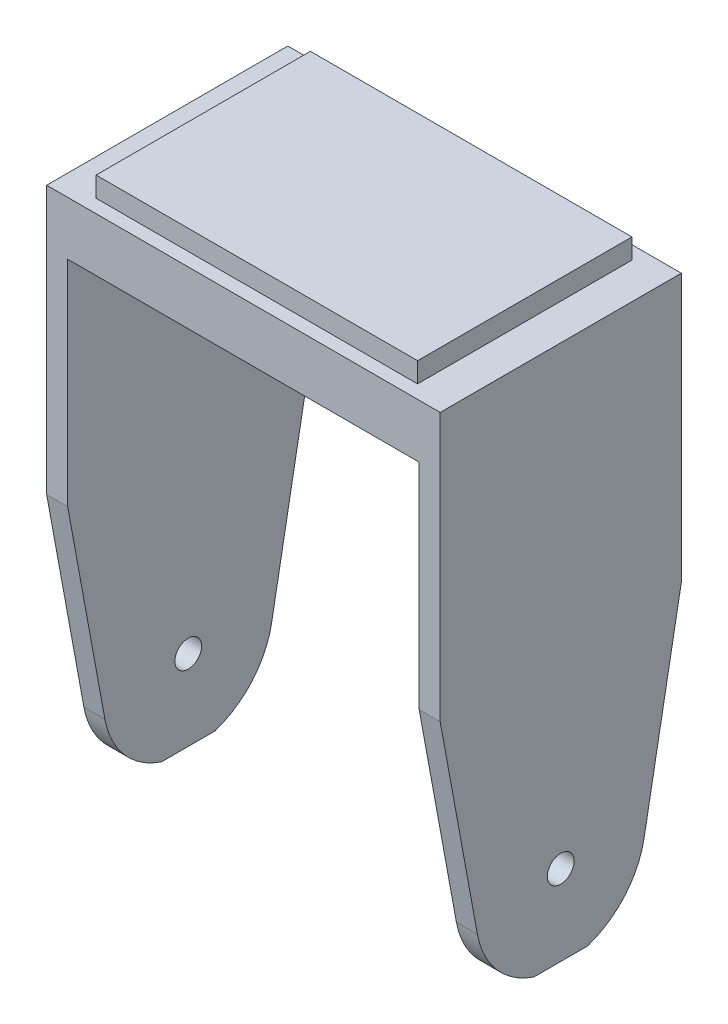
ISO-10303-21;
HEADER;
FILE_DESCRIPTION(('STEP AP214'),'2;1');
FILE_NAME('part.step','',(''),(''),'','','');
FILE_SCHEMA(('AUTOMOTIVE_DESIGN { 1 0 10303 214 1 1 1 1 }'));
ENDSEC;
DATA;
#1=APPLICATION_CONTEXT('core data for automotive mechanical design processes');
#2=APPLICATION_PROTOCOL_DEFINITION('international standard','automotive_design',2000,#1);
#3=PRODUCT_CONTEXT('',#1,'mechanical');
#4=PRODUCT('Part','Part','',(#3));
#5=PRODUCT_RELATED_PRODUCT_CATEGORY('part','',(#4));
#6=PRODUCT_DEFINITION_FORMATION('','',#4);
#7=PRODUCT_DEFINITION_CONTEXT('part definition',#1,'design');
#8=PRODUCT_DEFINITION('design','',#6,#7);
#9=PRODUCT_DEFINITION_SHAPE('','',#8);
#10=(LENGTH_UNIT() NAMED_UNIT(*) SI_UNIT(.MILLI.,.METRE.));
#11=(NAMED_UNIT(*) PLANE_ANGLE_UNIT() SI_UNIT($,.RADIAN.));
#12=(NAMED_UNIT(*) SI_UNIT($,.STERADIAN.) SOLID_ANGLE_UNIT());
#13=UNCERTAINTY_MEASURE_WITH_UNIT(LENGTH_MEASURE(1.E-05),#10,'distance_accuracy_value','');
#14=(GEOMETRIC_REPRESENTATION_CONTEXT(3) GLOBAL_UNCERTAINTY_ASSIGNED_CONTEXT((#13)) GLOBAL_UNIT_ASSIGNED_CONTEXT((#10,
#11,#12)) REPRESENTATION_CONTEXT('',''));
#15=CARTESIAN_POINT('',(0.,0.,0.));
#16=DIRECTION('',(0.,0.,1.));
#17=DIRECTION('',(1.,0.,0.));
#18=AXIS2_PLACEMENT_3D('',#15,#16,#17);
#19=CARTESIAN_POINT('',(23.3172,-8.73125,-14.2875));
#20=DIRECTION('',(0.,1.,0.));
#21=DIRECTION('',(0.,0.,1.));
#22=AXIS2_PLACEMENT_3D('',#19,#20,#21);
#23=PLANE('',#22);
#24=DIRECTION('',(0.,0.,1.));
#25=VECTOR('',#24,1.);
#26=CARTESIAN_POINT('',(20.828,-8.73125,-14.2875));
#27=LINE('',#26,#25);
#28=CARTESIAN_POINT('',(20.828,-8.73125,-14.2875));
#29=VERTEX_POINT('',#28);
#30=CARTESIAN_POINT('',(20.828,-8.73125,14.2875));
#31=VERTEX_POINT('',#30);
#32=EDGE_CURVE('E378',#29,#31,#27,.T.);
#33=ORIENTED_EDGE('',*,*,#32,.T.);
#34=DIRECTION('',(-1.,0.,0.));
#35=VECTOR('',#34,1.);
#36=CARTESIAN_POINT('',(23.3172,-8.73125,14.2875));
#37=LINE('',#36,#35);
#38=CARTESIAN_POINT('',(-20.828,-8.73125,14.2875));
#39=VERTEX_POINT('',#38);
#40=EDGE_CURVE('E364',#31,#39,#37,.T.);
#41=ORIENTED_EDGE('',*,*,#40,.T.);
#42=DIRECTION('',(0.,0.,1.));
#43=VECTOR('',#42,1.);
#44=CARTESIAN_POINT('',(-20.828,-8.73125,14.2875));
#45=LINE('',#44,#43);
#46=CARTESIAN_POINT('',(-20.828,-8.73125,-14.2875));
#47=VERTEX_POINT('',#46);
#48=EDGE_CURVE('E605',#47,#39,#45,.T.);
#49=ORIENTED_EDGE('',*,*,#48,.F.);
#50=DIRECTION('',(1.,0.,0.));
#51=VECTOR('',#50,1.);
#52=CARTESIAN_POINT('',(23.3172,-8.73125,-14.2875));
#53=LINE('',#52,#51);
#54=EDGE_CURVE('E383',#47,#29,#53,.T.);
#55=ORIENTED_EDGE('',*,*,#54,.T.);
#56=EDGE_LOOP('',(#33,#41,#49,#55));
#57=FACE_BOUND('',#56,.T.);
#58=ADVANCED_FACE('F360',(#57),#23,.F.);
#59=CARTESIAN_POINT('',(-19.05,-2.38125,-12.7));
#60=DIRECTION('',(-1.,0.,0.));
#61=DIRECTION('',(0.,0.,1.));
#62=AXIS2_PLACEMENT_3D('',#59,#60,#61);
#63=PLANE('',#62);
#64=DIRECTION('',(0.,0.,1.));
#65=VECTOR('',#64,1.);
#66=CARTESIAN_POINT('',(-19.05,0.,-12.7));
#67=LINE('',#66,#65);
#68=CARTESIAN_POINT('',(-19.05,0.,-12.7));
#69=VERTEX_POINT('',#68);
#70=CARTESIAN_POINT('',(-19.05,0.,12.7));
#71=VERTEX_POINT('',#70);
#72=EDGE_CURVE('E509',#69,#71,#67,.T.);
#73=ORIENTED_EDGE('',*,*,#72,.F.);
#74=DIRECTION('',(0.,1.,0.));
#75=VECTOR('',#74,1.);
#76=CARTESIAN_POINT('',(-19.05,-2.38125,-12.7));
#77=LINE('',#76,#75);
#78=CARTESIAN_POINT('',(-19.05,-2.38125,-12.7));
#79=VERTEX_POINT('',#78);
#80=EDGE_CURVE('E11',#79,#69,#77,.T.);
#81=ORIENTED_EDGE('',*,*,#80,.F.);
#82=DIRECTION('',(0.,0.,1.));
#83=VECTOR('',#82,1.);
#84=CARTESIAN_POINT('',(-19.05,-2.38125,-12.7));
#85=LINE('',#84,#83);
#86=CARTESIAN_POINT('',(-19.05,-2.38125,12.7));
#87=VERTEX_POINT('',#86);
#88=EDGE_CURVE('E656',#79,#87,#85,.T.);
#89=ORIENTED_EDGE('',*,*,#88,.T.);
#90=DIRECTION('',(0.,1.,0.));
#91=VECTOR('',#90,1.);
#92=CARTESIAN_POINT('',(-19.05,-2.38125,12.7));
#93=LINE('',#92,#91);
#94=EDGE_CURVE('E667',#87,#71,#93,.T.);
#95=ORIENTED_EDGE('',*,*,#94,.T.);
#96=EDGE_LOOP('',(#73,#81,#89,#95));
#97=FACE_BOUND('',#96,.T.);
#98=ADVANCED_FACE('F362',(#97),#63,.T.);
#99=CARTESIAN_POINT('',(-19.05,-2.38125,-12.7));
#100=DIRECTION('',(0.,0.,-1.));
#101=DIRECTION('',(-1.,0.,0.));
#102=AXIS2_PLACEMENT_3D('',#99,#100,#101);
#103=PLANE('',#102);
#104=DIRECTION('',(-1.,0.,0.));
#105=VECTOR('',#104,1.);
#106=CARTESIAN_POINT('',(-19.05,0.,-12.7));
#107=LINE('',#106,#105);
#108=CARTESIAN_POINT('',(19.05,0.,-12.7));
#109=VERTEX_POINT('',#108);
#110=EDGE_CURVE('E653',#109,#69,#107,.T.);
#111=ORIENTED_EDGE('',*,*,#110,.F.);
#112=DIRECTION('',(0.,1.,0.));
#113=VECTOR('',#112,1.);
#114=CARTESIAN_POINT('',(19.05,-2.38125,-12.7));
#115=LINE('',#114,#113);
#116=CARTESIAN_POINT('',(19.05,-2.38125,-12.7));
#117=VERTEX_POINT('',#116);
#118=EDGE_CURVE('E370',#117,#109,#115,.T.);
#119=ORIENTED_EDGE('',*,*,#118,.F.);
#120=DIRECTION('',(-1.,0.,0.));
#121=VECTOR('',#120,1.);
#122=CARTESIAN_POINT('',(-19.05,-2.38125,-12.7));
#123=LINE('',#122,#121);
#124=EDGE_CURVE('E665',#117,#79,#123,.T.);
#125=ORIENTED_EDGE('',*,*,#124,.T.);
#126=ORIENTED_EDGE('',*,*,#80,.T.);
#127=EDGE_LOOP('',(#111,#119,#125,#126));
#128=FACE_BOUND('',#127,.T.);
#129=ADVANCED_FACE('F685',(#128),#103,.T.);
#130=CARTESIAN_POINT('',(19.05,-2.38125,-12.7));
#131=DIRECTION('',(1.,0.,0.));
#132=DIRECTION('',(0.,0.,-1.));
#133=AXIS2_PLACEMENT_3D('',#130,#131,#132);
#134=PLANE('',#133);
#135=DIRECTION('',(0.,0.,-1.));
#136=VECTOR('',#135,1.);
#137=CARTESIAN_POINT('',(19.05,0.,-12.7));
#138=LINE('',#137,#136);
#139=CARTESIAN_POINT('',(19.05,0.,12.7));
#140=VERTEX_POINT('',#139);
#141=EDGE_CURVE('E650',#140,#109,#138,.T.);
#142=ORIENTED_EDGE('',*,*,#141,.F.);
#143=DIRECTION('',(0.,1.,0.));
#144=VECTOR('',#143,1.);
#145=CARTESIAN_POINT('',(19.05,-2.38125,12.7));
#146=LINE('',#145,#144);
#147=CARTESIAN_POINT('',(19.05,-2.38125,12.7));
#148=VERTEX_POINT('',#147);
#149=EDGE_CURVE('E670',#148,#140,#146,.T.);
#150=ORIENTED_EDGE('',*,*,#149,.F.);
#151=DIRECTION('',(0.,0.,-1.));
#152=VECTOR('',#151,1.);
#153=CARTESIAN_POINT('',(19.05,-2.38125,-12.7));
#154=LINE('',#153,#152);
#155=EDGE_CURVE('E662',#148,#117,#154,.T.);
#156=ORIENTED_EDGE('',*,*,#155,.T.);
#157=ORIENTED_EDGE('',*,*,#118,.T.);
#158=EDGE_LOOP('',(#142,#150,#156,#157));
#159=FACE_BOUND('',#158,.T.);
#160=ADVANCED_FACE('F690',(#159),#134,.T.);
#161=CARTESIAN_POINT('',(-19.05,-2.38125,12.7));
#162=DIRECTION('',(0.,0.,1.));
#163=DIRECTION('',(1.,0.,0.));
#164=AXIS2_PLACEMENT_3D('',#161,#162,#163);
#165=PLANE('',#164);
#166=DIRECTION('',(1.,0.,0.));
#167=VECTOR('',#166,1.);
#168=CARTESIAN_POINT('',(-19.05,0.,12.7));
#169=LINE('',#168,#167);
#170=EDGE_CURVE('E647',#71,#140,#169,.T.);
#171=ORIENTED_EDGE('',*,*,#170,.F.);
#172=ORIENTED_EDGE('',*,*,#94,.F.);
#173=DIRECTION('',(1.,0.,0.));
#174=VECTOR('',#173,1.);
#175=CARTESIAN_POINT('',(-19.05,-2.38125,12.7));
#176=LINE('',#175,#174);
#177=EDGE_CURVE('E659',#87,#148,#176,.T.);
#178=ORIENTED_EDGE('',*,*,#177,.T.);
#179=ORIENTED_EDGE('',*,*,#149,.T.);
#180=EDGE_LOOP('',(#171,#172,#178,#179));
#181=FACE_BOUND('',#180,.T.);
#182=ADVANCED_FACE('F677',(#181),#165,.T.);
#183=CARTESIAN_POINT('',(-19.05,0.,12.7));
#184=DIRECTION('',(0.,1.,0.));
#185=DIRECTION('',(0.,0.,1.));
#186=AXIS2_PLACEMENT_3D('',#183,#184,#185);
#187=PLANE('',#186);
#188=ORIENTED_EDGE('',*,*,#72,.T.);
#189=ORIENTED_EDGE('',*,*,#170,.T.);
#190=ORIENTED_EDGE('',*,*,#141,.T.);
#191=ORIENTED_EDGE('',*,*,#110,.T.);
#192=EDGE_LOOP('',(#188,#189,#190,#191));
#193=FACE_BOUND('',#192,.T.);
#194=ADVANCED_FACE('F681',(#193),#187,.T.);
#195=CARTESIAN_POINT('',(23.3172,-8.73125,14.2875));
#196=DIRECTION('',(-1.,0.,0.));
#197=DIRECTION('',(0.,0.,1.));
#198=AXIS2_PLACEMENT_3D('',#195,#196,#197);
#199=PLANE('',#198);
#200=DIRECTION('',(0.,0.,1.));
#201=VECTOR('',#200,1.);
#202=CARTESIAN_POINT('',(23.3172,-2.38125,14.2875));
#203=LINE('',#202,#201);
#204=CARTESIAN_POINT('',(23.3172,-2.38125,-14.2875));
#205=VERTEX_POINT('',#204);
#206=CARTESIAN_POINT('',(23.3172,-2.38125,14.2875));
#207=VERTEX_POINT('',#206);
#208=EDGE_CURVE('E507',#205,#207,#203,.T.);
#209=ORIENTED_EDGE('',*,*,#208,.T.);
#210=DIRECTION('',(0.,1.,0.));
#211=VECTOR('',#210,1.);
#212=CARTESIAN_POINT('',(23.3172,-8.73125,14.2875));
#213=LINE('',#212,#211);
#214=CARTESIAN_POINT('',(23.3172,-34.13125,14.2875));
#215=VERTEX_POINT('',#214);
#216=EDGE_CURVE('E498',#215,#207,#213,.T.);
#217=ORIENTED_EDGE('',*,*,#216,.F.);
#218=DIRECTION('',(0.,-0.983567719638267,-0.180539582600546));
#219=VECTOR('',#218,1.);
#220=CARTESIAN_POINT('',(23.3172,-34.13125,14.2875));
#221=LINE('',#220,#219);
#222=CARTESIAN_POINT('',(23.3172,-58.1689092170474,9.87524767096264));
#223=VERTEX_POINT('',#222);
#224=EDGE_CURVE('E504',#215,#223,#221,.T.);
#225=ORIENTED_EDGE('',*,*,#224,.T.);
#226=CARTESIAN_POINT('',(23.3172,-56.35625,0.));
#227=DIRECTION('',(1.,0.,0.));
#228=DIRECTION('',(0.,0.,-1.));
#229=AXIS2_PLACEMENT_3D('',#226,#227,#228);
#230=CIRCLE('',#229,10.0402315710346);
#231=CARTESIAN_POINT('',(23.3172,-65.88125,3.175));
#232=VERTEX_POINT('',#231);
#233=EDGE_CURVE('E525',#223,#232,#230,.T.);
#234=ORIENTED_EDGE('',*,*,#233,.T.);
#235=DIRECTION('',(0.,0.,-1.));
#236=VECTOR('',#235,1.);
#237=CARTESIAN_POINT('',(23.3172,-65.88125,3.175));
#238=LINE('',#237,#236);
#239=CARTESIAN_POINT('',(23.3172,-65.88125,-3.175));
#240=VERTEX_POINT('',#239);
#241=EDGE_CURVE('E528',#232,#240,#238,.T.);
#242=ORIENTED_EDGE('',*,*,#241,.T.);
#243=CARTESIAN_POINT('',(23.3172,-56.35625,0.));
#244=DIRECTION('',(1.,0.,0.));
#245=DIRECTION('',(0.,0.,-1.));
#246=AXIS2_PLACEMENT_3D('',#243,#244,#245);
#247=CIRCLE('',#246,10.0402315710346);
#248=CARTESIAN_POINT('',(23.3172,-58.1689092170474,-9.87524767096263));
#249=VERTEX_POINT('',#248);
#250=EDGE_CURVE('E537',#240,#249,#247,.T.);
#251=ORIENTED_EDGE('',*,*,#250,.T.);
#252=DIRECTION('',(0.,0.983567719638267,-0.180539582600546));
#253=VECTOR('',#252,1.);
#254=CARTESIAN_POINT('',(23.3172,-58.1689092170474,-9.87524767096263));
#255=LINE('',#254,#253);
#256=CARTESIAN_POINT('',(23.3172,-34.13125,-14.2875));
#257=VERTEX_POINT('',#256);
#258=EDGE_CURVE('E540',#249,#257,#255,.T.);
#259=ORIENTED_EDGE('',*,*,#258,.T.);
#260=DIRECTION('',(0.,1.,0.));
#261=VECTOR('',#260,1.);
#262=CARTESIAN_POINT('',(23.3172,-8.73125,-14.2875));
#263=LINE('',#262,#261);
#264=EDGE_CURVE('E629',#257,#205,#263,.T.);
#265=ORIENTED_EDGE('',*,*,#264,.T.);
#266=EDGE_LOOP('',(#209,#217,#225,#234,#242,#251,#259,#265));
#267=FACE_BOUND('',#266,.T.);
#268=CARTESIAN_POINT('',(23.3172,-56.35625,0.));
#269=DIRECTION('',(1.,0.,0.));
#270=DIRECTION('',(0.,0.,-1.));
#271=AXIS2_PLACEMENT_3D('',#268,#269,#270);
#272=CIRCLE('',#271,1.5875);
#273=CARTESIAN_POINT('',(23.3172,-56.35625,-1.58750000000001));
#274=VERTEX_POINT('',#273);
#275=EDGE_CURVE('E531',#274,#274,#272,.T.);
#276=ORIENTED_EDGE('',*,*,#275,.F.);
#277=EDGE_LOOP('',(#276));
#278=FACE_BOUND('',#277,.T.);
#279=ADVANCED_FACE('F500',(#267,#278),#199,.F.);
#280=CARTESIAN_POINT('',(23.3172,-8.73125,14.2875));
#281=DIRECTION('',(0.,0.,-1.));
#282=DIRECTION('',(-1.,0.,0.));
#283=AXIS2_PLACEMENT_3D('',#280,#281,#282);
#284=PLANE('',#283);
#285=DIRECTION('',(-1.,0.,0.));
#286=VECTOR('',#285,1.);
#287=CARTESIAN_POINT('',(23.3172,-2.38125,14.2875));
#288=LINE('',#287,#286);
#289=CARTESIAN_POINT('',(-23.3172,-2.38125,14.2875));
#290=VERTEX_POINT('',#289);
#291=EDGE_CURVE('E636',#207,#290,#288,.T.);
#292=ORIENTED_EDGE('',*,*,#291,.T.);
#293=DIRECTION('',(0.,1.,0.));
#294=VECTOR('',#293,1.);
#295=CARTESIAN_POINT('',(-23.3172,-8.73125,14.2875));
#296=LINE('',#295,#294);
#297=CARTESIAN_POINT('',(-23.3172,-34.13125,14.2875));
#298=VERTEX_POINT('',#297);
#299=EDGE_CURVE('E510',#298,#290,#296,.T.);
#300=ORIENTED_EDGE('',*,*,#299,.F.);
#301=DIRECTION('',(-1.,0.,0.));
#302=VECTOR('',#301,1.);
#303=CARTESIAN_POINT('',(-20.828,-34.13125,14.2875));
#304=LINE('',#303,#302);
#305=CARTESIAN_POINT('',(-20.828,-34.13125,14.2875));
#306=VERTEX_POINT('',#305);
#307=EDGE_CURVE('E890',#306,#298,#304,.T.);
#308=ORIENTED_EDGE('',*,*,#307,.F.);
#309=DIRECTION('',(0.,-1.,0.));
#310=VECTOR('',#309,1.);
#311=CARTESIAN_POINT('',(-20.828,-8.73125,14.2875));
#312=LINE('',#311,#310);
#313=EDGE_CURVE('E588',#39,#306,#312,.T.);
#314=ORIENTED_EDGE('',*,*,#313,.F.);
#315=ORIENTED_EDGE('',*,*,#40,.F.);
#316=DIRECTION('',(0.,-1.,0.));
#317=VECTOR('',#316,1.);
#318=CARTESIAN_POINT('',(20.828,-8.73125,14.2875));
#319=LINE('',#318,#317);
#320=CARTESIAN_POINT('',(20.828,-34.13125,14.2875));
#321=VERTEX_POINT('',#320);
#322=EDGE_CURVE('E516',#31,#321,#319,.T.);
#323=ORIENTED_EDGE('',*,*,#322,.T.);
#324=DIRECTION('',(1.,0.,0.));
#325=VECTOR('',#324,1.);
#326=CARTESIAN_POINT('',(20.828,-34.13125,14.2875));
#327=LINE('',#326,#325);
#328=EDGE_CURVE('E513',#321,#215,#327,.T.);
#329=ORIENTED_EDGE('',*,*,#328,.T.);
#330=ORIENTED_EDGE('',*,*,#216,.T.);
#331=EDGE_LOOP('',(#292,#300,#308,#314,#315,#323,#329,#330));
#332=FACE_BOUND('',#331,.T.);
#333=ADVANCED_FACE('F514',(#332),#284,.F.);
#334=CARTESIAN_POINT('',(-23.3172,-8.73125,14.2875));
#335=DIRECTION('',(1.,0.,0.));
#336=DIRECTION('',(0.,0.,-1.));
#337=AXIS2_PLACEMENT_3D('',#334,#335,#336);
#338=PLANE('',#337);
#339=DIRECTION('',(0.,0.,-1.));
#340=VECTOR('',#339,1.);
#341=CARTESIAN_POINT('',(-23.3172,-2.38125,14.2875));
#342=LINE('',#341,#340);
#343=CARTESIAN_POINT('',(-23.3172,-2.38125,-14.2875));
#344=VERTEX_POINT('',#343);
#345=EDGE_CURVE('E633',#290,#344,#342,.T.);
#346=ORIENTED_EDGE('',*,*,#345,.T.);
#347=DIRECTION('',(0.,1.,0.));
#348=VECTOR('',#347,1.);
#349=CARTESIAN_POINT('',(-23.3172,-8.73125,-14.2875));
#350=LINE('',#349,#348);
#351=CARTESIAN_POINT('',(-23.3172,-34.13125,-14.2875));
#352=VERTEX_POINT('',#351);
#353=EDGE_CURVE('E630',#352,#344,#350,.T.);
#354=ORIENTED_EDGE('',*,*,#353,.F.);
#355=DIRECTION('',(0.,0.983567719638267,-0.180539582600546));
#356=VECTOR('',#355,1.);
#357=CARTESIAN_POINT('',(-23.3172,-34.13125,-14.2875));
#358=LINE('',#357,#356);
#359=CARTESIAN_POINT('',(-23.3172,-58.1689092170474,-9.87524767096264));
#360=VERTEX_POINT('',#359);
#361=EDGE_CURVE('E585',#360,#352,#358,.T.);
#362=ORIENTED_EDGE('',*,*,#361,.F.);
#363=CARTESIAN_POINT('',(-23.3172,-56.35625,0.));
#364=DIRECTION('',(1.,0.,0.));
#365=DIRECTION('',(0.,0.,1.));
#366=AXIS2_PLACEMENT_3D('',#363,#364,#365);
#367=CIRCLE('',#366,10.0402315710346);
#368=CARTESIAN_POINT('',(-23.3172,-65.88125,-3.17500000000001));
#369=VERTEX_POINT('',#368);
#370=EDGE_CURVE('E583',#369,#360,#367,.T.);
#371=ORIENTED_EDGE('',*,*,#370,.F.);
#372=DIRECTION('',(0.,0.,-1.));
#373=VECTOR('',#372,1.);
#374=CARTESIAN_POINT('',(-23.3172,-65.88125,-3.17500000000001));
#375=LINE('',#374,#373);
#376=CARTESIAN_POINT('',(-23.3172,-65.88125,3.17499999999999));
#377=VERTEX_POINT('',#376);
#378=EDGE_CURVE('E581',#377,#369,#375,.T.);
#379=ORIENTED_EDGE('',*,*,#378,.F.);
#380=CARTESIAN_POINT('',(-23.3172,-56.35625,0.));
#381=DIRECTION('',(1.,0.,0.));
#382=DIRECTION('',(0.,0.,-1.));
#383=AXIS2_PLACEMENT_3D('',#380,#381,#382);
#384=CIRCLE('',#383,10.0402315710346);
#385=CARTESIAN_POINT('',(-23.3172,-58.1689092170474,9.87524767096264));
#386=VERTEX_POINT('',#385);
#387=EDGE_CURVE('E579',#386,#377,#384,.T.);
#388=ORIENTED_EDGE('',*,*,#387,.F.);
#389=DIRECTION('',(0.,-0.983567719638267,-0.180539582600546));
#390=VECTOR('',#389,1.);
#391=CARTESIAN_POINT('',(-23.3172,-34.13125,14.2875));
#392=LINE('',#391,#390);
#393=EDGE_CURVE('E577',#298,#386,#392,.T.);
#394=ORIENTED_EDGE('',*,*,#393,.F.);
#395=ORIENTED_EDGE('',*,*,#299,.T.);
#396=EDGE_LOOP('',(#346,#354,#362,#371,#379,#388,#394,#395));
#397=FACE_BOUND('',#396,.T.);
#398=CARTESIAN_POINT('',(-23.3172,-56.35625,0.));
#399=DIRECTION('',(1.,0.,0.));
#400=DIRECTION('',(0.,0.,-1.));
#401=AXIS2_PLACEMENT_3D('',#398,#399,#400);
#402=CIRCLE('',#401,1.5875);
#403=CARTESIAN_POINT('',(-23.3172,-56.35625,-1.58750000000001));
#404=VERTEX_POINT('',#403);
#405=EDGE_CURVE('E564',#404,#404,#402,.T.);
#406=ORIENTED_EDGE('',*,*,#405,.T.);
#407=EDGE_LOOP('',(#406));
#408=FACE_BOUND('',#407,.T.);
#409=ADVANCED_FACE('F710',(#397,#408),#338,.F.);
#410=CARTESIAN_POINT('',(23.3172,-8.73125,-14.2875));
#411=DIRECTION('',(0.,0.,1.));
#412=DIRECTION('',(1.,0.,0.));
#413=AXIS2_PLACEMENT_3D('',#410,#411,#412);
#414=PLANE('',#413);
#415=DIRECTION('',(1.,0.,0.));
#416=VECTOR('',#415,1.);
#417=CARTESIAN_POINT('',(23.3172,-2.38125,-14.2875));
#418=LINE('',#417,#416);
#419=EDGE_CURVE('E632',#344,#205,#418,.T.);
#420=ORIENTED_EDGE('',*,*,#419,.T.);
#421=ORIENTED_EDGE('',*,*,#264,.F.);
#422=DIRECTION('',(1.,0.,0.));
#423=VECTOR('',#422,1.);
#424=CARTESIAN_POINT('',(20.828,-34.13125,-14.2875));
#425=LINE('',#424,#423);
#426=CARTESIAN_POINT('',(20.828,-34.13125,-14.2875));
#427=VERTEX_POINT('',#426);
#428=EDGE_CURVE('E561',#427,#257,#425,.T.);
#429=ORIENTED_EDGE('',*,*,#428,.F.);
#430=DIRECTION('',(0.,1.,0.));
#431=VECTOR('',#430,1.);
#432=CARTESIAN_POINT('',(20.828,-34.13125,-14.2875));
#433=LINE('',#432,#431);
#434=EDGE_CURVE('E521',#427,#29,#433,.T.);
#435=ORIENTED_EDGE('',*,*,#434,.T.);
#436=ORIENTED_EDGE('',*,*,#54,.F.);
#437=DIRECTION('',(0.,1.,0.));
#438=VECTOR('',#437,1.);
#439=CARTESIAN_POINT('',(-20.828,-8.73125,-14.2875));
#440=LINE('',#439,#438);
#441=CARTESIAN_POINT('',(-20.828,-34.13125,-14.2875));
#442=VERTEX_POINT('',#441);
#443=EDGE_CURVE('E599',#442,#47,#440,.T.);
#444=ORIENTED_EDGE('',*,*,#443,.F.);
#445=DIRECTION('',(-1.,0.,0.));
#446=VECTOR('',#445,1.);
#447=CARTESIAN_POINT('',(-20.828,-34.13125,-14.2875));
#448=LINE('',#447,#446);
#449=EDGE_CURVE('E602',#442,#352,#448,.T.);
#450=ORIENTED_EDGE('',*,*,#449,.T.);
#451=ORIENTED_EDGE('',*,*,#353,.T.);
#452=EDGE_LOOP('',(#420,#421,#429,#435,#436,#444,#450,#451));
#453=FACE_BOUND('',#452,.T.);
#454=ADVANCED_FACE('F626',(#453),#414,.F.);
#455=CARTESIAN_POINT('',(23.3172,-2.38125,-14.2875));
#456=DIRECTION('',(0.,1.,0.));
#457=DIRECTION('',(0.,0.,1.));
#458=AXIS2_PLACEMENT_3D('',#455,#456,#457);
#459=PLANE('',#458);
#460=ORIENTED_EDGE('',*,*,#177,.F.);
#461=ORIENTED_EDGE('',*,*,#88,.F.);
#462=ORIENTED_EDGE('',*,*,#124,.F.);
#463=ORIENTED_EDGE('',*,*,#155,.F.);
#464=EDGE_LOOP('',(#460,#461,#462,#463));
#465=FACE_BOUND('',#464,.T.);
#466=ORIENTED_EDGE('',*,*,#208,.F.);
#467=ORIENTED_EDGE('',*,*,#419,.F.);
#468=ORIENTED_EDGE('',*,*,#345,.F.);
#469=ORIENTED_EDGE('',*,*,#291,.F.);
#470=EDGE_LOOP('',(#466,#467,#468,#469));
#471=FACE_BOUND('',#470,.T.);
#472=ADVANCED_FACE('F687',(#465,#471),#459,.T.);
#473=CARTESIAN_POINT('',(-20.828,-56.35625,0.));
#474=DIRECTION('',(1.,0.,0.));
#475=DIRECTION('',(0.,0.,-1.));
#476=AXIS2_PLACEMENT_3D('',#473,#474,#475);
#477=PLANE('',#476);
#478=ORIENTED_EDGE('',*,*,#313,.T.);
#479=DIRECTION('',(0.,-0.983567719638267,-0.180539582600546));
#480=VECTOR('',#479,1.);
#481=CARTESIAN_POINT('',(-20.828,-34.13125,14.2875));
#482=LINE('',#481,#480);
#483=CARTESIAN_POINT('',(-20.828,-58.1689092170474,9.87524767096264));
#484=VERTEX_POINT('',#483);
#485=EDGE_CURVE('E589',#306,#484,#482,.T.);
#486=ORIENTED_EDGE('',*,*,#485,.T.);
#487=CARTESIAN_POINT('',(-20.828,-56.35625,0.));
#488=DIRECTION('',(1.,0.,0.));
#489=DIRECTION('',(0.,0.,-1.));
#490=AXIS2_PLACEMENT_3D('',#487,#488,#489);
#491=CIRCLE('',#490,10.0402315710346);
#492=CARTESIAN_POINT('',(-20.828,-65.88125,3.17499999999999));
#493=VERTEX_POINT('',#492);
#494=EDGE_CURVE('E591',#484,#493,#491,.T.);
#495=ORIENTED_EDGE('',*,*,#494,.T.);
#496=DIRECTION('',(0.,0.,-1.));
#497=VECTOR('',#496,1.);
#498=CARTESIAN_POINT('',(-20.828,-65.88125,-3.17500000000001));
#499=LINE('',#498,#497);
#500=CARTESIAN_POINT('',(-20.828,-65.88125,-3.17500000000001));
#501=VERTEX_POINT('',#500);
#502=EDGE_CURVE('E593',#493,#501,#499,.T.);
#503=ORIENTED_EDGE('',*,*,#502,.T.);
#504=CARTESIAN_POINT('',(-20.828,-56.35625,0.));
#505=DIRECTION('',(1.,0.,0.));
#506=DIRECTION('',(0.,0.,1.));
#507=AXIS2_PLACEMENT_3D('',#504,#505,#506);
#508=CIRCLE('',#507,10.0402315710346);
#509=CARTESIAN_POINT('',(-20.828,-58.1689092170474,-9.87524767096264));
#510=VERTEX_POINT('',#509);
#511=EDGE_CURVE('E595',#501,#510,#508,.T.);
#512=ORIENTED_EDGE('',*,*,#511,.T.);
#513=DIRECTION('',(0.,0.983567719638267,-0.180539582600546));
#514=VECTOR('',#513,1.);
#515=CARTESIAN_POINT('',(-20.828,-34.13125,-14.2875));
#516=LINE('',#515,#514);
#517=EDGE_CURVE('E597',#510,#442,#516,.T.);
#518=ORIENTED_EDGE('',*,*,#517,.T.);
#519=ORIENTED_EDGE('',*,*,#443,.T.);
#520=ORIENTED_EDGE('',*,*,#48,.T.);
#521=EDGE_LOOP('',(#478,#486,#495,#503,#512,#518,#519,#520));
#522=FACE_BOUND('',#521,.T.);
#523=CARTESIAN_POINT('',(-20.828,-56.35625,0.));
#524=DIRECTION('',(1.,0.,0.));
#525=DIRECTION('',(0.,0.,-1.));
#526=AXIS2_PLACEMENT_3D('',#523,#524,#525);
#527=CIRCLE('',#526,1.5875);
#528=CARTESIAN_POINT('',(-20.828,-56.35625,-1.58750000000001));
#529=VERTEX_POINT('',#528);
#530=EDGE_CURVE('E574',#529,#529,#527,.T.);
#531=ORIENTED_EDGE('',*,*,#530,.F.);
#532=EDGE_LOOP('',(#531));
#533=FACE_BOUND('',#532,.T.);
#534=ADVANCED_FACE('F619',(#522,#533),#477,.T.);
#535=CARTESIAN_POINT('',(-20.828,-34.13125,14.2875));
#536=DIRECTION('',(0.,0.180539582600546,-0.983567719638267));
#537=DIRECTION('',(0.,0.983567719638267,0.180539582600546));
#538=AXIS2_PLACEMENT_3D('',#535,#536,#537);
#539=PLANE('',#538);
#540=ORIENTED_EDGE('',*,*,#393,.T.);
#541=DIRECTION('',(-1.,0.,0.));
#542=VECTOR('',#541,1.);
#543=CARTESIAN_POINT('',(-20.828,-58.1689092170474,9.87524767096264));
#544=LINE('',#543,#542);
#545=EDGE_CURVE('E893',#484,#386,#544,.T.);
#546=ORIENTED_EDGE('',*,*,#545,.F.);
#547=ORIENTED_EDGE('',*,*,#485,.F.);
#548=ORIENTED_EDGE('',*,*,#307,.T.);
#549=EDGE_LOOP('',(#540,#546,#547,#548));
#550=FACE_BOUND('',#549,.T.);
#551=ADVANCED_FACE('F754',(#550),#539,.F.);
#552=CARTESIAN_POINT('',(-20.828,-56.35625,0.));
#553=DIRECTION('',(-1.,0.,0.));
#554=DIRECTION('',(0.,0.,1.));
#555=AXIS2_PLACEMENT_3D('',#552,#553,#554);
#556=CYLINDRICAL_SURFACE('',#555,10.0402315710346);
#557=ORIENTED_EDGE('',*,*,#387,.T.);
#558=DIRECTION('',(-1.,0.,0.));
#559=VECTOR('',#558,1.);
#560=CARTESIAN_POINT('',(-20.828,-65.88125,3.17499999999999));
#561=LINE('',#560,#559);
#562=EDGE_CURVE('E898',#493,#377,#561,.T.);
#563=ORIENTED_EDGE('',*,*,#562,.F.);
#564=ORIENTED_EDGE('',*,*,#494,.F.);
#565=ORIENTED_EDGE('',*,*,#545,.T.);
#566=EDGE_LOOP('',(#557,#563,#564,#565));
#567=FACE_BOUND('',#566,.T.);
#568=ADVANCED_FACE('F761',(#567),#556,.T.);
#569=CARTESIAN_POINT('',(-20.828,-65.88125,-3.17500000000001));
#570=DIRECTION('',(0.,1.,0.));
#571=DIRECTION('',(0.,0.,1.));
#572=AXIS2_PLACEMENT_3D('',#569,#570,#571);
#573=PLANE('',#572);
#574=ORIENTED_EDGE('',*,*,#378,.T.);
#575=DIRECTION('',(-1.,0.,0.));
#576=VECTOR('',#575,1.);
#577=CARTESIAN_POINT('',(-20.828,-65.88125,-3.17500000000001));
#578=LINE('',#577,#576);
#579=EDGE_CURVE('E901',#501,#369,#578,.T.);
#580=ORIENTED_EDGE('',*,*,#579,.F.);
#581=ORIENTED_EDGE('',*,*,#502,.F.);
#582=ORIENTED_EDGE('',*,*,#562,.T.);
#583=EDGE_LOOP('',(#574,#580,#581,#582));
#584=FACE_BOUND('',#583,.T.);
#585=ADVANCED_FACE('F768',(#584),#573,.F.);
#586=CARTESIAN_POINT('',(-20.828,-56.35625,0.));
#587=DIRECTION('',(-1.,0.,0.));
#588=DIRECTION('',(0.,0.,1.));
#589=AXIS2_PLACEMENT_3D('',#586,#587,#588);
#590=CYLINDRICAL_SURFACE('',#589,10.0402315710346);
#591=ORIENTED_EDGE('',*,*,#370,.T.);
#592=DIRECTION('',(-1.,0.,0.));
#593=VECTOR('',#592,1.);
#594=CARTESIAN_POINT('',(-20.828,-58.1689092170474,-9.87524767096264));
#595=LINE('',#594,#593);
#596=EDGE_CURVE('E903',#510,#360,#595,.T.);
#597=ORIENTED_EDGE('',*,*,#596,.F.);
#598=ORIENTED_EDGE('',*,*,#511,.F.);
#599=ORIENTED_EDGE('',*,*,#579,.T.);
#600=EDGE_LOOP('',(#591,#597,#598,#599));
#601=FACE_BOUND('',#600,.T.);
#602=ADVANCED_FACE('F776',(#601),#590,.T.);
#603=CARTESIAN_POINT('',(-20.828,-34.13125,-14.2875));
#604=DIRECTION('',(0.,0.180539582600546,0.983567719638267));
#605=DIRECTION('',(0.,-0.983567719638267,0.180539582600546));
#606=AXIS2_PLACEMENT_3D('',#603,#604,#605);
#607=PLANE('',#606);
#608=ORIENTED_EDGE('',*,*,#361,.T.);
#609=ORIENTED_EDGE('',*,*,#449,.F.);
#610=ORIENTED_EDGE('',*,*,#517,.F.);
#611=ORIENTED_EDGE('',*,*,#596,.T.);
#612=EDGE_LOOP('',(#608,#609,#610,#611));
#613=FACE_BOUND('',#612,.T.);
#614=ADVANCED_FACE('F784',(#613),#607,.F.);
#615=CARTESIAN_POINT('',(-20.828,-56.35625,0.));
#616=DIRECTION('',(-1.,0.,0.));
#617=DIRECTION('',(0.,0.,1.));
#618=AXIS2_PLACEMENT_3D('',#615,#616,#617);
#619=CYLINDRICAL_SURFACE('',#618,1.5875);
#620=ORIENTED_EDGE('',*,*,#530,.T.);
#621=EDGE_LOOP('',(#620));
#622=FACE_BOUND('',#621,.T.);
#623=ORIENTED_EDGE('',*,*,#405,.F.);
#624=EDGE_LOOP('',(#623));
#625=FACE_BOUND('',#624,.T.);
#626=ADVANCED_FACE('F791',(#622,#625),#619,.F.);
#627=CARTESIAN_POINT('',(20.828,-58.1689092170474,-9.87524767096263));
#628=DIRECTION('',(0.,-0.180539582600546,-0.983567719638267));
#629=DIRECTION('',(0.,0.983567719638267,-0.180539582600546));
#630=AXIS2_PLACEMENT_3D('',#627,#628,#629);
#631=PLANE('',#630);
#632=ORIENTED_EDGE('',*,*,#258,.F.);
#633=DIRECTION('',(1.,0.,0.));
#634=VECTOR('',#633,1.);
#635=CARTESIAN_POINT('',(20.828,-58.1689092170474,-9.87524767096263));
#636=LINE('',#635,#634);
#637=CARTESIAN_POINT('',(20.828,-58.1689092170474,-9.87524767096263));
#638=VERTEX_POINT('',#637);
#639=EDGE_CURVE('E565',#638,#249,#636,.T.);
#640=ORIENTED_EDGE('',*,*,#639,.F.);
#641=DIRECTION('',(0.,0.983567719638267,-0.180539582600546));
#642=VECTOR('',#641,1.);
#643=CARTESIAN_POINT('',(20.828,-58.1689092170474,-9.87524767096263));
#644=LINE('',#643,#642);
#645=EDGE_CURVE('E556',#638,#427,#644,.T.);
#646=ORIENTED_EDGE('',*,*,#645,.T.);
#647=ORIENTED_EDGE('',*,*,#428,.T.);
#648=EDGE_LOOP('',(#632,#640,#646,#647));
#649=FACE_BOUND('',#648,.T.);
#650=ADVANCED_FACE('F798',(#649),#631,.T.);
#651=CARTESIAN_POINT('',(20.828,-56.35625,0.));
#652=DIRECTION('',(1.,0.,0.));
#653=DIRECTION('',(0.,0.,-1.));
#654=AXIS2_PLACEMENT_3D('',#651,#652,#653);
#655=CYLINDRICAL_SURFACE('',#654,10.0402315710346);
#656=ORIENTED_EDGE('',*,*,#250,.F.);
#657=DIRECTION('',(1.,0.,0.));
#658=VECTOR('',#657,1.);
#659=CARTESIAN_POINT('',(20.828,-65.88125,-3.175));
#660=LINE('',#659,#658);
#661=CARTESIAN_POINT('',(20.828,-65.88125,-3.175));
#662=VERTEX_POINT('',#661);
#663=EDGE_CURVE('E567',#662,#240,#660,.T.);
#664=ORIENTED_EDGE('',*,*,#663,.F.);
#665=CARTESIAN_POINT('',(20.828,-56.35625,0.));
#666=DIRECTION('',(1.,0.,0.));
#667=DIRECTION('',(0.,0.,-1.));
#668=AXIS2_PLACEMENT_3D('',#665,#666,#667);
#669=CIRCLE('',#668,10.0402315710346);
#670=EDGE_CURVE('E553',#662,#638,#669,.T.);
#671=ORIENTED_EDGE('',*,*,#670,.T.);
#672=ORIENTED_EDGE('',*,*,#639,.T.);
#673=EDGE_LOOP('',(#656,#664,#671,#672));
#674=FACE_BOUND('',#673,.T.);
#675=ADVANCED_FACE('F829',(#674),#655,.T.);
#676=CARTESIAN_POINT('',(20.828,-65.88125,3.175));
#677=DIRECTION('',(0.,-1.,0.));
#678=DIRECTION('',(0.,0.,-1.));
#679=AXIS2_PLACEMENT_3D('',#676,#677,#678);
#680=PLANE('',#679);
#681=ORIENTED_EDGE('',*,*,#241,.F.);
#682=DIRECTION('',(1.,0.,0.));
#683=VECTOR('',#682,1.);
#684=CARTESIAN_POINT('',(20.828,-65.88125,3.175));
#685=LINE('',#684,#683);
#686=CARTESIAN_POINT('',(20.828,-65.88125,3.175));
#687=VERTEX_POINT('',#686);
#688=EDGE_CURVE('E569',#687,#232,#685,.T.);
#689=ORIENTED_EDGE('',*,*,#688,.F.);
#690=DIRECTION('',(0.,0.,-1.));
#691=VECTOR('',#690,1.);
#692=CARTESIAN_POINT('',(20.828,-65.88125,3.175));
#693=LINE('',#692,#691);
#694=EDGE_CURVE('E550',#687,#662,#693,.T.);
#695=ORIENTED_EDGE('',*,*,#694,.T.);
#696=ORIENTED_EDGE('',*,*,#663,.T.);
#697=EDGE_LOOP('',(#681,#689,#695,#696));
#698=FACE_BOUND('',#697,.T.);
#699=ADVANCED_FACE('F837',(#698),#680,.T.);
#700=CARTESIAN_POINT('',(20.828,-56.35625,0.));
#701=DIRECTION('',(1.,0.,0.));
#702=DIRECTION('',(0.,0.,-1.));
#703=AXIS2_PLACEMENT_3D('',#700,#701,#702);
#704=CYLINDRICAL_SURFACE('',#703,10.0402315710346);
#705=ORIENTED_EDGE('',*,*,#233,.F.);
#706=DIRECTION('',(1.,0.,0.));
#707=VECTOR('',#706,1.);
#708=CARTESIAN_POINT('',(20.828,-58.1689092170474,9.87524767096264));
#709=LINE('',#708,#707);
#710=CARTESIAN_POINT('',(20.828,-58.1689092170474,9.87524767096264));
#711=VERTEX_POINT('',#710);
#712=EDGE_CURVE('E520',#711,#223,#709,.T.);
#713=ORIENTED_EDGE('',*,*,#712,.F.);
#714=CARTESIAN_POINT('',(20.828,-56.35625,0.));
#715=DIRECTION('',(1.,0.,0.));
#716=DIRECTION('',(0.,0.,-1.));
#717=AXIS2_PLACEMENT_3D('',#714,#715,#716);
#718=CIRCLE('',#717,10.0402315710346);
#719=EDGE_CURVE('E547',#711,#687,#718,.T.);
#720=ORIENTED_EDGE('',*,*,#719,.T.);
#721=ORIENTED_EDGE('',*,*,#688,.T.);
#722=EDGE_LOOP('',(#705,#713,#720,#721));
#723=FACE_BOUND('',#722,.T.);
#724=ADVANCED_FACE('F845',(#723),#704,.T.);
#725=CARTESIAN_POINT('',(20.828,-34.13125,14.2875));
#726=DIRECTION('',(0.,-0.180539582600546,0.983567719638267));
#727=DIRECTION('',(0.,-0.983567719638267,-0.180539582600546));
#728=AXIS2_PLACEMENT_3D('',#725,#726,#727);
#729=PLANE('',#728);
#730=ORIENTED_EDGE('',*,*,#224,.F.);
#731=ORIENTED_EDGE('',*,*,#328,.F.);
#732=DIRECTION('',(0.,-0.983567719638267,-0.180539582600546));
#733=VECTOR('',#732,1.);
#734=CARTESIAN_POINT('',(20.828,-34.13125,14.2875));
#735=LINE('',#734,#733);
#736=EDGE_CURVE('E545',#321,#711,#735,.T.);
#737=ORIENTED_EDGE('',*,*,#736,.T.);
#738=ORIENTED_EDGE('',*,*,#712,.T.);
#739=EDGE_LOOP('',(#730,#731,#737,#738));
#740=FACE_BOUND('',#739,.T.);
#741=ADVANCED_FACE('F523',(#740),#729,.T.);
#742=CARTESIAN_POINT('',(20.828,-56.35625,0.));
#743=DIRECTION('',(1.,0.,0.));
#744=DIRECTION('',(0.,0.,-1.));
#745=AXIS2_PLACEMENT_3D('',#742,#743,#744);
#746=PLANE('',#745);
#747=CARTESIAN_POINT('',(20.828,-56.35625,0.));
#748=DIRECTION('',(1.,0.,0.));
#749=DIRECTION('',(0.,0.,-1.));
#750=AXIS2_PLACEMENT_3D('',#747,#748,#749);
#751=CIRCLE('',#750,1.5875);
#752=CARTESIAN_POINT('',(20.828,-56.35625,-1.58750000000001));
#753=VERTEX_POINT('',#752);
#754=EDGE_CURVE('E526',#753,#753,#751,.T.);
#755=ORIENTED_EDGE('',*,*,#754,.T.);
#756=EDGE_LOOP('',(#755));
#757=FACE_BOUND('',#756,.T.);
#758=ORIENTED_EDGE('',*,*,#32,.F.);
#759=ORIENTED_EDGE('',*,*,#434,.F.);
#760=ORIENTED_EDGE('',*,*,#645,.F.);
#761=ORIENTED_EDGE('',*,*,#670,.F.);
#762=ORIENTED_EDGE('',*,*,#694,.F.);
#763=ORIENTED_EDGE('',*,*,#719,.F.);
#764=ORIENTED_EDGE('',*,*,#736,.F.);
#765=ORIENTED_EDGE('',*,*,#322,.F.);
#766=EDGE_LOOP('',(#758,#759,#760,#761,#762,#763,#764,#765));
#767=FACE_BOUND('',#766,.T.);
#768=ADVANCED_FACE('F860',(#757,#767),#746,.F.);
#769=CARTESIAN_POINT('',(20.828,-56.35625,0.));
#770=DIRECTION('',(1.,0.,0.));
#771=DIRECTION('',(0.,0.,-1.));
#772=AXIS2_PLACEMENT_3D('',#769,#770,#771);
#773=CYLINDRICAL_SURFACE('',#772,1.5875);
#774=ORIENTED_EDGE('',*,*,#754,.F.);
#775=EDGE_LOOP('',(#774));
#776=FACE_BOUND('',#775,.T.);
#777=ORIENTED_EDGE('',*,*,#275,.T.);
#778=EDGE_LOOP('',(#777));
#779=FACE_BOUND('',#778,.T.);
#780=ADVANCED_FACE('F867',(#776,#779),#773,.F.);
#781=CLOSED_SHELL('',(#58,#98,#129,#160,#182,#194,#279,#333,#409,#454,#472,#534,#551,#568,#585,
#602,#614,#626,#650,#675,#699,#724,#741,#768,#780));
#782=MANIFOLD_SOLID_BREP('B2',#781);
#783=ADVANCED_BREP_SHAPE_REPRESENTATION('',(#18,#782),#14);
#784=SHAPE_DEFINITION_REPRESENTATION(#9,#783);
ENDSEC;
END-ISO-10303-21;
